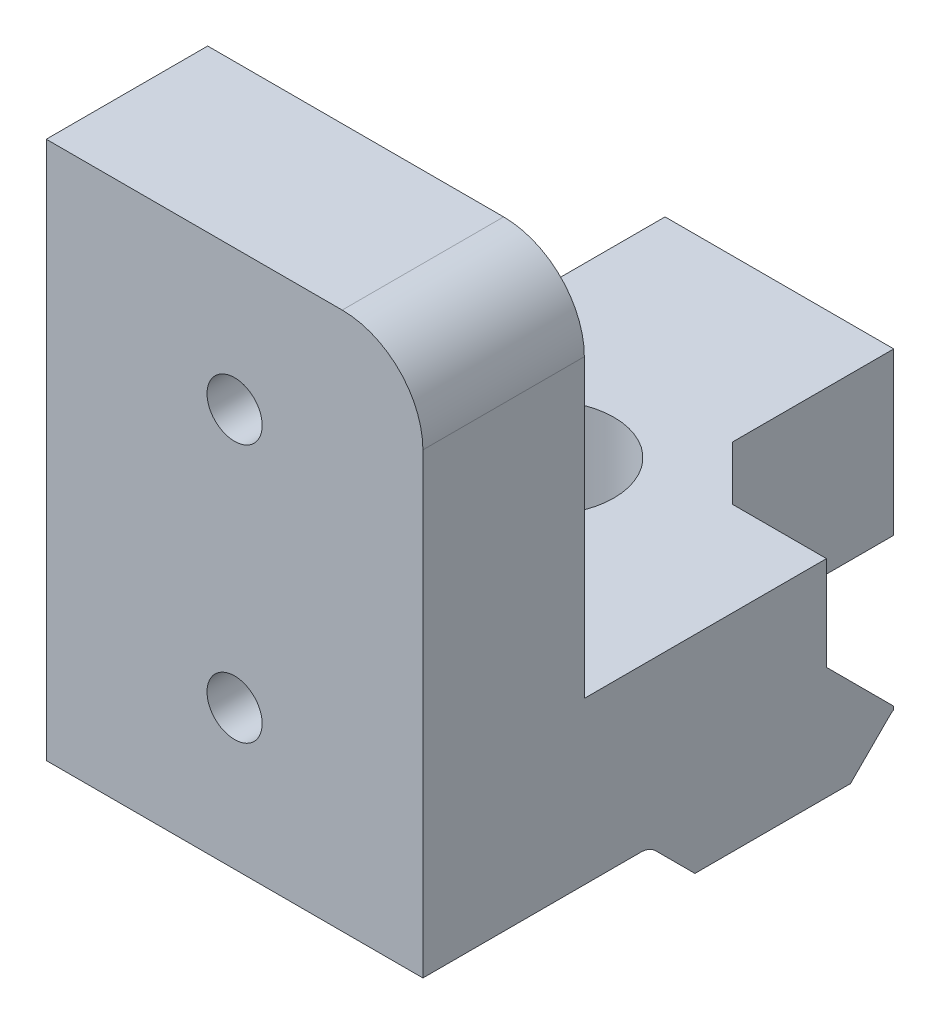
ISO-10303-21;
HEADER;
FILE_DESCRIPTION(('STEP AP214'),'2;1');
FILE_NAME('part.step','',(''),(''),'','','');
FILE_SCHEMA(('AUTOMOTIVE_DESIGN { 1 0 10303 214 1 1 1 1 }'));
ENDSEC;
DATA;
#1=APPLICATION_CONTEXT('core data for automotive mechanical design processes');
#2=APPLICATION_PROTOCOL_DEFINITION('international standard','automotive_design',2000,#1);
#3=PRODUCT_CONTEXT('',#1,'mechanical');
#4=PRODUCT('Part','Part','',(#3));
#5=PRODUCT_RELATED_PRODUCT_CATEGORY('part','',(#4));
#6=PRODUCT_DEFINITION_FORMATION('','',#4);
#7=PRODUCT_DEFINITION_CONTEXT('part definition',#1,'design');
#8=PRODUCT_DEFINITION('design','',#6,#7);
#9=PRODUCT_DEFINITION_SHAPE('','',#8);
#10=(LENGTH_UNIT() NAMED_UNIT(*) SI_UNIT(.MILLI.,.METRE.));
#11=(NAMED_UNIT(*) PLANE_ANGLE_UNIT() SI_UNIT($,.RADIAN.));
#12=(NAMED_UNIT(*) SI_UNIT($,.STERADIAN.) SOLID_ANGLE_UNIT());
#13=UNCERTAINTY_MEASURE_WITH_UNIT(LENGTH_MEASURE(1.E-05),#10,'distance_accuracy_value','');
#14=(GEOMETRIC_REPRESENTATION_CONTEXT(3) GLOBAL_UNCERTAINTY_ASSIGNED_CONTEXT((#13)) GLOBAL_UNIT_ASSIGNED_CONTEXT((#10,
#11,#12)) REPRESENTATION_CONTEXT('',''));
#15=CARTESIAN_POINT('',(0.,0.,0.));
#16=DIRECTION('',(0.,0.,1.));
#17=DIRECTION('',(1.,0.,0.));
#18=AXIS2_PLACEMENT_3D('',#15,#16,#17);
#19=CARTESIAN_POINT('',(46.3642843340703,35.7650594637958,0.));
#20=DIRECTION('',(0.,1.,0.));
#21=DIRECTION('',(0.,0.,1.));
#22=AXIS2_PLACEMENT_3D('',#19,#20,#21);
#23=PLANE('',#22);
#24=DIRECTION('',(-1.,0.,0.));
#25=VECTOR('',#24,1.);
#26=CARTESIAN_POINT('',(46.3642843340703,35.7650594637958,12.7830951969996));
#27=LINE('',#26,#25);
#28=CARTESIAN_POINT('',(46.3642843340703,35.7650594637958,12.7830951969996));
#29=VERTEX_POINT('',#28);
#30=CARTESIAN_POINT('',(32.3642843340703,35.7650594637958,12.7830951969996));
#31=VERTEX_POINT('',#30);
#32=EDGE_CURVE('E205',#29,#31,#27,.T.);
#33=ORIENTED_EDGE('',*,*,#32,.F.);
#34=DIRECTION('',(0.,0.,-1.));
#35=VECTOR('',#34,1.);
#36=CARTESIAN_POINT('',(46.3642843340703,35.7650594637958,0.));
#37=LINE('',#36,#35);
#38=CARTESIAN_POINT('',(46.3642843340703,35.7650594637958,20.8758664827248));
#39=VERTEX_POINT('',#38);
#40=EDGE_CURVE('E271',#39,#29,#37,.T.);
#41=ORIENTED_EDGE('',*,*,#40,.F.);
#42=DIRECTION('',(1.,0.,0.));
#43=VECTOR('',#42,1.);
#44=CARTESIAN_POINT('',(32.3642843340703,35.7650594637958,20.8758664827248));
#45=LINE('',#44,#43);
#46=CARTESIAN_POINT('',(32.3642843340703,35.7650594637958,20.8758664827248));
#47=VERTEX_POINT('',#46);
#48=EDGE_CURVE('E242',#47,#39,#45,.T.);
#49=ORIENTED_EDGE('',*,*,#48,.F.);
#50=DIRECTION('',(0.,0.,-1.));
#51=VECTOR('',#50,1.);
#52=CARTESIAN_POINT('',(32.3642843340703,35.7650594637958,0.));
#53=LINE('',#52,#51);
#54=EDGE_CURVE('E268',#47,#31,#53,.T.);
#55=ORIENTED_EDGE('',*,*,#54,.T.);
#56=EDGE_LOOP('',(#33,#41,#49,#55));
#57=FACE_BOUND('',#56,.T.);
#58=ADVANCED_FACE('F35',(#57),#23,.F.);
#59=CARTESIAN_POINT('',(46.3642843340703,34.9750594637958,12.7830951969996));
#60=DIRECTION('',(-1.,0.,0.));
#61=DIRECTION('',(0.,0.,1.));
#62=AXIS2_PLACEMENT_3D('',#59,#60,#61);
#63=CYLINDRICAL_SURFACE('',#62,0.789999999999999);
#64=CARTESIAN_POINT('',(32.3642843340703,34.9750594637958,12.7830951969996));
#65=DIRECTION('',(1.,0.,0.));
#66=DIRECTION('',(0.,0.,-1.));
#67=AXIS2_PLACEMENT_3D('',#64,#65,#66);
#68=CIRCLE('',#67,0.789999999999999);
#69=CARTESIAN_POINT('',(32.3642843340703,35.5336738209331,12.2244808398622));
#70=VERTEX_POINT('',#69);
#71=EDGE_CURVE('E291',#70,#31,#68,.T.);
#72=ORIENTED_EDGE('',*,*,#71,.F.);
#73=DIRECTION('',(-1.,0.,0.));
#74=VECTOR('',#73,1.);
#75=CARTESIAN_POINT('',(46.3642843340703,35.5336738209331,12.2244808398622));
#76=LINE('',#75,#74);
#77=CARTESIAN_POINT('',(46.3642843340703,35.5336738209331,12.2244808398622));
#78=VERTEX_POINT('',#77);
#79=EDGE_CURVE('E203',#78,#70,#76,.T.);
#80=ORIENTED_EDGE('',*,*,#79,.F.);
#81=CARTESIAN_POINT('',(46.3642843340703,34.9750594637958,12.7830951969996));
#82=DIRECTION('',(1.,0.,0.));
#83=DIRECTION('',(0.,0.,-1.));
#84=AXIS2_PLACEMENT_3D('',#81,#82,#83);
#85=CIRCLE('',#84,0.789999999999999);
#86=EDGE_CURVE('E273',#78,#29,#85,.T.);
#87=ORIENTED_EDGE('',*,*,#86,.T.);
#88=ORIENTED_EDGE('',*,*,#32,.T.);
#89=EDGE_LOOP('',(#72,#80,#87,#88));
#90=FACE_BOUND('',#89,.T.);
#91=ADVANCED_FACE('F341',(#90),#63,.F.);
#92=CARTESIAN_POINT('',(46.3642843340703,11.6545964905354,-11.6545964905355));
#93=DIRECTION('',(0.,-0.707106781186547,0.707106781186548));
#94=DIRECTION('',(0.,-0.707106781186548,-0.707106781186547));
#95=AXIS2_PLACEMENT_3D('',#92,#93,#94);
#96=PLANE('',#95);
#97=DIRECTION('',(0.,0.707106781186548,0.707106781186547));
#98=VECTOR('',#97,1.);
#99=CARTESIAN_POINT('',(32.3642843340703,11.6545964905354,-11.6545964905355));
#100=LINE('',#99,#98);
#101=CARTESIAN_POINT('',(32.3642843340703,34.0750594637958,10.7658664827248));
#102=VERTEX_POINT('',#101);
#103=EDGE_CURVE('E295',#102,#70,#100,.T.);
#104=ORIENTED_EDGE('',*,*,#103,.F.);
#105=DIRECTION('',(-1.,0.,0.));
#106=VECTOR('',#105,1.);
#107=CARTESIAN_POINT('',(46.3642843340703,34.0750594637958,10.7658664827248));
#108=LINE('',#107,#106);
#109=CARTESIAN_POINT('',(46.3642843340703,34.0750594637958,10.7658664827248));
#110=VERTEX_POINT('',#109);
#111=EDGE_CURVE('E201',#110,#102,#108,.T.);
#112=ORIENTED_EDGE('',*,*,#111,.F.);
#113=DIRECTION('',(0.,0.707106781186548,0.707106781186547));
#114=VECTOR('',#113,1.);
#115=CARTESIAN_POINT('',(46.3642843340703,11.6545964905354,-11.6545964905355));
#116=LINE('',#115,#114);
#117=EDGE_CURVE('E277',#110,#78,#116,.T.);
#118=ORIENTED_EDGE('',*,*,#117,.T.);
#119=ORIENTED_EDGE('',*,*,#79,.T.);
#120=EDGE_LOOP('',(#104,#112,#118,#119));
#121=FACE_BOUND('',#120,.T.);
#122=ADVANCED_FACE('F337',(#121),#96,.T.);
#123=CARTESIAN_POINT('',(46.3642843340703,34.0750594637958,0.));
#124=DIRECTION('',(0.,1.,0.));
#125=DIRECTION('',(0.,0.,1.));
#126=AXIS2_PLACEMENT_3D('',#123,#124,#125);
#127=PLANE('',#126);
#128=CARTESIAN_POINT('',(37.8642843340703,34.0750594637958,7.87586648272481));
#129=DIRECTION('',(0.,-1.,0.));
#130=DIRECTION('',(0.,0.,-1.));
#131=AXIS2_PLACEMENT_3D('',#128,#129,#130);
#132=CIRCLE('',#131,2.6);
#133=CARTESIAN_POINT('',(37.8642843340703,34.0750594637958,5.27586648272481));
#134=VERTEX_POINT('',#133);
#135=EDGE_CURVE('E265',#134,#134,#132,.T.);
#136=ORIENTED_EDGE('',*,*,#135,.F.);
#137=EDGE_LOOP('',(#136));
#138=FACE_BOUND('',#137,.T.);
#139=DIRECTION('',(0.,0.,-1.));
#140=VECTOR('',#139,1.);
#141=CARTESIAN_POINT('',(32.3642843340703,34.0750594637958,0.));
#142=LINE('',#141,#140);
#143=CARTESIAN_POINT('',(32.3642843340703,34.0750594637958,4.98586648272482));
#144=VERTEX_POINT('',#143);
#145=EDGE_CURVE('E298',#102,#144,#142,.T.);
#146=ORIENTED_EDGE('',*,*,#145,.T.);
#147=DIRECTION('',(-1.,0.,0.));
#148=VECTOR('',#147,1.);
#149=CARTESIAN_POINT('',(46.3642843340703,34.0750594637958,4.98586648272482));
#150=LINE('',#149,#148);
#151=CARTESIAN_POINT('',(46.3642843340703,34.0750594637958,4.98586648272482));
#152=VERTEX_POINT('',#151);
#153=EDGE_CURVE('E194',#152,#144,#150,.T.);
#154=ORIENTED_EDGE('',*,*,#153,.F.);
#155=DIRECTION('',(0.,0.,-1.));
#156=VECTOR('',#155,1.);
#157=CARTESIAN_POINT('',(46.3642843340703,34.0750594637958,0.));
#158=LINE('',#157,#156);
#159=EDGE_CURVE('E280',#110,#152,#158,.T.);
#160=ORIENTED_EDGE('',*,*,#159,.F.);
#161=ORIENTED_EDGE('',*,*,#111,.T.);
#162=EDGE_LOOP('',(#146,#154,#160,#161));
#163=FACE_BOUND('',#162,.T.);
#164=ADVANCED_FACE('F334',(#138,#163),#127,.F.);
#165=CARTESIAN_POINT('',(46.3642843340703,19.5304629732602,19.5304629732603));
#166=DIRECTION('',(0.,-0.707106781186547,-0.707106781186549));
#167=DIRECTION('',(0.,0.707106781186549,-0.707106781186546));
#168=AXIS2_PLACEMENT_3D('',#165,#166,#167);
#169=PLANE('',#168);
#170=DIRECTION('',(0.,-0.707106781186549,0.707106781186546));
#171=VECTOR('',#170,1.);
#172=CARTESIAN_POINT('',(32.3642843340703,19.5304629732602,19.5304629732603));
#173=LINE('',#172,#171);
#174=CARTESIAN_POINT('',(32.3642843340703,35.5336738209331,3.52725212558745));
#175=VERTEX_POINT('',#174);
#176=EDGE_CURVE('E301',#175,#144,#173,.T.);
#177=ORIENTED_EDGE('',*,*,#176,.F.);
#178=DIRECTION('',(-1.,0.,0.));
#179=VECTOR('',#178,1.);
#180=CARTESIAN_POINT('',(46.3642843340703,35.5336738209331,3.52725212558745));
#181=LINE('',#180,#179);
#182=CARTESIAN_POINT('',(46.3642843340703,35.5336738209331,3.52725212558745));
#183=VERTEX_POINT('',#182);
#184=EDGE_CURVE('E192',#183,#175,#181,.T.);
#185=ORIENTED_EDGE('',*,*,#184,.F.);
#186=DIRECTION('',(0.,-0.707106781186549,0.707106781186546));
#187=VECTOR('',#186,1.);
#188=CARTESIAN_POINT('',(46.3642843340703,19.5304629732602,19.5304629732603));
#189=LINE('',#188,#187);
#190=EDGE_CURVE('E282',#183,#152,#189,.T.);
#191=ORIENTED_EDGE('',*,*,#190,.T.);
#192=ORIENTED_EDGE('',*,*,#153,.T.);
#193=EDGE_LOOP('',(#177,#185,#191,#192));
#194=FACE_BOUND('',#193,.T.);
#195=ADVANCED_FACE('F329',(#194),#169,.T.);
#196=CARTESIAN_POINT('',(46.3642843340703,34.9750594637958,2.96863776845007));
#197=DIRECTION('',(-1.,0.,0.));
#198=DIRECTION('',(0.,0.,1.));
#199=AXIS2_PLACEMENT_3D('',#196,#197,#198);
#200=CYLINDRICAL_SURFACE('',#199,0.790000000000005);
#201=DIRECTION('',(-1.,0.,0.));
#202=VECTOR('',#201,1.);
#203=CARTESIAN_POINT('',(46.3642843340703,35.6520120280646,3.37586648272482));
#204=LINE('',#203,#202);
#205=CARTESIAN_POINT('',(46.3642843340703,35.6520120280646,3.37586648272482));
#206=VERTEX_POINT('',#205);
#207=CARTESIAN_POINT('',(40.8642843340703,35.6520120280646,3.37586648272482));
#208=VERTEX_POINT('',#207);
#209=EDGE_CURVE('E176',#206,#208,#204,.T.);
#210=ORIENTED_EDGE('',*,*,#209,.F.);
#211=CARTESIAN_POINT('',(46.3642843340703,34.9750594637958,2.96863776845007));
#212=DIRECTION('',(1.,0.,0.));
#213=DIRECTION('',(0.,0.,-1.));
#214=AXIS2_PLACEMENT_3D('',#211,#212,#213);
#215=CIRCLE('',#214,0.790000000000005);
#216=EDGE_CURVE('E285',#206,#183,#215,.T.);
#217=ORIENTED_EDGE('',*,*,#216,.T.);
#218=ORIENTED_EDGE('',*,*,#184,.T.);
#219=CARTESIAN_POINT('',(32.3642843340703,34.9750594637958,2.96863776845007));
#220=DIRECTION('',(1.,0.,0.));
#221=DIRECTION('',(0.,0.,-1.));
#222=AXIS2_PLACEMENT_3D('',#219,#220,#221);
#223=CIRCLE('',#222,0.790000000000005);
#224=CARTESIAN_POINT('',(32.3642843340703,35.7650594637958,2.96863776845007));
#225=VERTEX_POINT('',#224);
#226=EDGE_CURVE('E191',#225,#175,#223,.T.);
#227=ORIENTED_EDGE('',*,*,#226,.F.);
#228=DIRECTION('',(-1.,0.,0.));
#229=VECTOR('',#228,1.);
#230=CARTESIAN_POINT('',(46.3642843340703,35.7650594637958,2.96863776845007));
#231=LINE('',#230,#229);
#232=CARTESIAN_POINT('',(40.8642843340703,35.7650594637958,2.96863776845007));
#233=VERTEX_POINT('',#232);
#234=EDGE_CURVE('E182',#233,#225,#231,.T.);
#235=ORIENTED_EDGE('',*,*,#234,.F.);
#236=CARTESIAN_POINT('',(40.8642843340703,34.9750594637958,2.96863776845007));
#237=DIRECTION('',(-1.,0.,0.));
#238=DIRECTION('',(0.,0.,1.));
#239=AXIS2_PLACEMENT_3D('',#236,#237,#238);
#240=CIRCLE('',#239,0.790000000000005);
#241=EDGE_CURVE('E164',#208,#233,#240,.T.);
#242=ORIENTED_EDGE('',*,*,#241,.F.);
#243=EDGE_LOOP('',(#210,#217,#218,#227,#235,#242));
#244=FACE_BOUND('',#243,.T.);
#245=ADVANCED_FACE('F189',(#244),#200,.F.);
#246=DIRECTION('',(-1.,0.,0.));
#247=VECTOR('',#246,1.);
#248=CARTESIAN_POINT('',(46.3642843340703,35.7650594637958,-2.12413351727518));
#249=LINE('',#248,#247);
#250=CARTESIAN_POINT('',(40.8642843340703,35.7650594637958,-2.12413351727518));
#251=VERTEX_POINT('',#250);
#252=CARTESIAN_POINT('',(32.3642843340703,35.7650594637958,-2.12413351727518));
#253=VERTEX_POINT('',#252);
#254=EDGE_CURVE('E184',#251,#253,#249,.T.);
#255=ORIENTED_EDGE('',*,*,#254,.F.);
#256=DIRECTION('',(0.,0.,-1.));
#257=VECTOR('',#256,1.);
#258=CARTESIAN_POINT('',(40.8642843340703,35.7650594637958,5.87586648272482));
#259=LINE('',#258,#257);
#260=EDGE_CURVE('E168',#233,#251,#259,.T.);
#261=ORIENTED_EDGE('',*,*,#260,.F.);
#262=ORIENTED_EDGE('',*,*,#234,.T.);
#263=EDGE_CURVE('E292',#225,#253,#53,.T.);
#264=ORIENTED_EDGE('',*,*,#263,.T.);
#265=EDGE_LOOP('',(#255,#261,#262,#264));
#266=FACE_BOUND('',#265,.T.);
#267=ADVANCED_FACE('F180',(#266),#23,.F.);
#268=CARTESIAN_POINT('',(46.3642843340703,0.,-2.12413351727518));
#269=DIRECTION('',(0.,0.,1.));
#270=DIRECTION('',(1.,0.,0.));
#271=AXIS2_PLACEMENT_3D('',#268,#269,#270);
#272=PLANE('',#271);
#273=DIRECTION('',(-1.,0.,0.));
#274=VECTOR('',#273,1.);
#275=CARTESIAN_POINT('',(46.3642843340703,41.7650594637958,-2.12413351727518));
#276=LINE('',#275,#274);
#277=CARTESIAN_POINT('',(40.8642843340703,41.7650594637958,-2.12413351727518));
#278=VERTEX_POINT('',#277);
#279=CARTESIAN_POINT('',(32.3642843340703,41.7650594637958,-2.12413351727518));
#280=VERTEX_POINT('',#279);
#281=EDGE_CURVE('E196',#278,#280,#276,.T.);
#282=ORIENTED_EDGE('',*,*,#281,.F.);
#283=DIRECTION('',(0.,1.,0.));
#284=VECTOR('',#283,1.);
#285=CARTESIAN_POINT('',(40.8642843340703,26.056815544322,-2.12413351727518));
#286=LINE('',#285,#284);
#287=EDGE_CURVE('E186',#251,#278,#286,.T.);
#288=ORIENTED_EDGE('',*,*,#287,.F.);
#289=ORIENTED_EDGE('',*,*,#254,.T.);
#290=DIRECTION('',(0.,1.,0.));
#291=VECTOR('',#290,1.);
#292=CARTESIAN_POINT('',(32.3642843340703,0.,-2.12413351727518));
#293=LINE('',#292,#291);
#294=EDGE_CURVE('E305',#253,#280,#293,.T.);
#295=ORIENTED_EDGE('',*,*,#294,.T.);
#296=EDGE_LOOP('',(#282,#288,#289,#295));
#297=FACE_BOUND('',#296,.T.);
#298=ADVANCED_FACE('F323',(#297),#272,.F.);
#299=CARTESIAN_POINT('',(46.3642843340703,41.7650594637958,0.));
#300=DIRECTION('',(0.,1.,0.));
#301=DIRECTION('',(0.,0.,1.));
#302=AXIS2_PLACEMENT_3D('',#299,#300,#301);
#303=PLANE('',#302);
#304=DIRECTION('',(0.,0.,1.));
#305=VECTOR('',#304,1.);
#306=CARTESIAN_POINT('',(40.8642843340703,41.7650594637958,5.87586648272482));
#307=LINE('',#306,#305);
#308=CARTESIAN_POINT('',(40.8642843340703,41.7650594637958,3.87586648272482));
#309=VERTEX_POINT('',#308);
#310=EDGE_CURVE('E175',#278,#309,#307,.T.);
#311=ORIENTED_EDGE('',*,*,#310,.F.);
#312=ORIENTED_EDGE('',*,*,#281,.T.);
#313=DIRECTION('',(0.,0.,-1.));
#314=VECTOR('',#313,1.);
#315=CARTESIAN_POINT('',(32.3642843340703,41.7650594637958,0.));
#316=LINE('',#315,#314);
#317=CARTESIAN_POINT('',(32.3642843340703,41.7650594637958,14.8758664827248));
#318=VERTEX_POINT('',#317);
#319=EDGE_CURVE('E274',#318,#280,#316,.T.);
#320=ORIENTED_EDGE('',*,*,#319,.F.);
#321=DIRECTION('',(-1.,0.,0.));
#322=VECTOR('',#321,1.);
#323=CARTESIAN_POINT('',(46.3642843340703,41.7650594637958,14.8758664827248));
#324=LINE('',#323,#322);
#325=CARTESIAN_POINT('',(38.7234840531715,41.7650594637958,14.8758664827248));
#326=VERTEX_POINT('',#325);
#327=EDGE_CURVE('E259',#326,#318,#324,.T.);
#328=ORIENTED_EDGE('',*,*,#327,.F.);
#329=CARTESIAN_POINT('',(40.0050846149692,41.7650594637958,14.8758664827248));
#330=VERTEX_POINT('',#329);
#331=EDGE_CURVE('E264',#330,#326,#324,.T.);
#332=ORIENTED_EDGE('',*,*,#331,.F.);
#333=CARTESIAN_POINT('',(46.3642843340703,41.7650594637958,14.8758664827248));
#334=VERTEX_POINT('',#333);
#335=EDGE_CURVE('E260',#334,#330,#324,.T.);
#336=ORIENTED_EDGE('',*,*,#335,.F.);
#337=DIRECTION('',(0.,0.,-1.));
#338=VECTOR('',#337,1.);
#339=CARTESIAN_POINT('',(46.3642843340703,41.7650594637958,0.));
#340=LINE('',#339,#338);
#341=CARTESIAN_POINT('',(46.3642843340703,41.7650594637958,5.87586648272482));
#342=VERTEX_POINT('',#341);
#343=EDGE_CURVE('E287',#334,#342,#340,.T.);
#344=ORIENTED_EDGE('',*,*,#343,.T.);
#345=DIRECTION('',(1.,0.,0.));
#346=VECTOR('',#345,1.);
#347=CARTESIAN_POINT('',(40.8642843340703,41.7650594637958,5.87586648272482));
#348=LINE('',#347,#346);
#349=CARTESIAN_POINT('',(42.8642843340704,41.7650594637958,5.87586648272482));
#350=VERTEX_POINT('',#349);
#351=EDGE_CURVE('E360',#350,#342,#348,.T.);
#352=ORIENTED_EDGE('',*,*,#351,.F.);
#353=DIRECTION('',(0.707106781186552,0.,0.707106781186543));
#354=VECTOR('',#353,1.);
#355=CARTESIAN_POINT('',(42.8642843340704,41.7650594637958,5.87586648272482));
#356=LINE('',#355,#354);
#357=EDGE_CURVE('E212',#350,#309,#356,.F.);
#358=ORIENTED_EDGE('',*,*,#357,.T.);
#359=EDGE_LOOP('',(#311,#312,#320,#328,#332,#336,#344,#352,#358));
#360=FACE_BOUND('',#359,.T.);
#361=CARTESIAN_POINT('',(37.8642843340703,41.7650594637958,7.87586648272481));
#362=DIRECTION('',(0.,1.,0.));
#363=DIRECTION('',(0.,0.,1.));
#364=AXIS2_PLACEMENT_3D('',#361,#362,#363);
#365=CIRCLE('',#364,2.6);
#366=CARTESIAN_POINT('',(37.8642843340703,41.7650594637958,10.4758664827248));
#367=VERTEX_POINT('',#366);
#368=EDGE_CURVE('E263',#367,#367,#365,.F.);
#369=ORIENTED_EDGE('',*,*,#368,.T.);
#370=EDGE_LOOP('',(#369));
#371=FACE_BOUND('',#370,.T.);
#372=ADVANCED_FACE('F313',(#360,#371),#303,.T.);
#373=CARTESIAN_POINT('',(46.3642843340703,0.,0.));
#374=DIRECTION('',(1.,0.,0.));
#375=DIRECTION('',(0.,0.,-1.));
#376=AXIS2_PLACEMENT_3D('',#373,#374,#375);
#377=PLANE('',#376);
#378=DIRECTION('',(0.,1.,0.));
#379=VECTOR('',#378,1.);
#380=CARTESIAN_POINT('',(46.3642843340703,35.7650594637958,14.8758664827248));
#381=LINE('',#380,#379);
#382=CARTESIAN_POINT('',(46.3642843340703,52.7650594637958,14.8758664827248));
#383=VERTEX_POINT('',#382);
#384=EDGE_CURVE('E235',#334,#383,#381,.T.);
#385=ORIENTED_EDGE('',*,*,#384,.T.);
#386=DIRECTION('',(0.,0.,1.));
#387=VECTOR('',#386,1.);
#388=CARTESIAN_POINT('',(46.3642843340703,52.7650594637958,0.));
#389=LINE('',#388,#387);
#390=CARTESIAN_POINT('',(46.3642843340703,52.7650594637958,20.8758664827248));
#391=VERTEX_POINT('',#390);
#392=EDGE_CURVE('E225',#383,#391,#389,.T.);
#393=ORIENTED_EDGE('',*,*,#392,.T.);
#394=DIRECTION('',(0.,1.,0.));
#395=VECTOR('',#394,1.);
#396=CARTESIAN_POINT('',(46.3642843340703,35.7650594637958,20.8758664827248));
#397=LINE('',#396,#395);
#398=EDGE_CURVE('E233',#39,#391,#397,.T.);
#399=ORIENTED_EDGE('',*,*,#398,.F.);
#400=ORIENTED_EDGE('',*,*,#40,.T.);
#401=ORIENTED_EDGE('',*,*,#86,.F.);
#402=ORIENTED_EDGE('',*,*,#117,.F.);
#403=ORIENTED_EDGE('',*,*,#159,.T.);
#404=ORIENTED_EDGE('',*,*,#190,.F.);
#405=ORIENTED_EDGE('',*,*,#216,.F.);
#406=DIRECTION('',(0.,1.,0.));
#407=VECTOR('',#406,1.);
#408=CARTESIAN_POINT('',(46.3642843340703,34.0750594637958,3.37586648272482));
#409=LINE('',#408,#407);
#410=CARTESIAN_POINT('',(46.3642843340703,35.7650594637958,3.37586648272482));
#411=VERTEX_POINT('',#410);
#412=EDGE_CURVE('E366',#206,#411,#409,.T.);
#413=ORIENTED_EDGE('',*,*,#412,.T.);
#414=DIRECTION('',(0.,0.707106781186551,0.707106781186544));
#415=VECTOR('',#414,1.);
#416=CARTESIAN_POINT('',(46.3642843340703,38.2650594637958,5.87586648272482));
#417=LINE('',#416,#415);
#418=CARTESIAN_POINT('',(46.3642843340703,38.2650594637958,5.87586648272482));
#419=VERTEX_POINT('',#418);
#420=EDGE_CURVE('E223',#411,#419,#417,.T.);
#421=ORIENTED_EDGE('',*,*,#420,.T.);
#422=DIRECTION('',(0.,1.,0.));
#423=VECTOR('',#422,1.);
#424=CARTESIAN_POINT('',(46.3642843340703,26.056815544322,5.87586648272482));
#425=LINE('',#424,#423);
#426=EDGE_CURVE('E358',#419,#342,#425,.T.);
#427=ORIENTED_EDGE('',*,*,#426,.T.);
#428=ORIENTED_EDGE('',*,*,#343,.F.);
#429=EDGE_LOOP('',(#385,#393,#399,#400,#401,#402,#403,#404,#405,#413,#421,#427,#428));
#430=FACE_BOUND('',#429,.T.);
#431=ADVANCED_FACE('F232',(#430),#377,.T.);
#432=CARTESIAN_POINT('',(32.3642843340703,0.,0.));
#433=DIRECTION('',(1.,0.,0.));
#434=DIRECTION('',(0.,0.,-1.));
#435=AXIS2_PLACEMENT_3D('',#432,#433,#434);
#436=PLANE('',#435);
#437=DIRECTION('',(0.,-1.,0.));
#438=VECTOR('',#437,1.);
#439=CARTESIAN_POINT('',(32.3642843340703,35.7650594637958,14.8758664827248));
#440=LINE('',#439,#438);
#441=CARTESIAN_POINT('',(32.3642843340703,55.7650594637958,14.8758664827248));
#442=VERTEX_POINT('',#441);
#443=EDGE_CURVE('E245',#442,#318,#440,.T.);
#444=ORIENTED_EDGE('',*,*,#443,.T.);
#445=ORIENTED_EDGE('',*,*,#319,.T.);
#446=ORIENTED_EDGE('',*,*,#294,.F.);
#447=ORIENTED_EDGE('',*,*,#263,.F.);
#448=ORIENTED_EDGE('',*,*,#226,.T.);
#449=ORIENTED_EDGE('',*,*,#176,.T.);
#450=ORIENTED_EDGE('',*,*,#145,.F.);
#451=ORIENTED_EDGE('',*,*,#103,.T.);
#452=ORIENTED_EDGE('',*,*,#71,.T.);
#453=ORIENTED_EDGE('',*,*,#54,.F.);
#454=DIRECTION('',(0.,-1.,0.));
#455=VECTOR('',#454,1.);
#456=CARTESIAN_POINT('',(32.3642843340703,35.7650594637958,20.8758664827248));
#457=LINE('',#456,#455);
#458=CARTESIAN_POINT('',(32.3642843340703,55.7650594637958,20.8758664827248));
#459=VERTEX_POINT('',#458);
#460=EDGE_CURVE('E247',#459,#47,#457,.T.);
#461=ORIENTED_EDGE('',*,*,#460,.F.);
#462=DIRECTION('',(0.,0.,1.));
#463=VECTOR('',#462,1.);
#464=CARTESIAN_POINT('',(32.3642843340703,55.7650594637958,14.8758664827248));
#465=LINE('',#464,#463);
#466=EDGE_CURVE('E256',#442,#459,#465,.T.);
#467=ORIENTED_EDGE('',*,*,#466,.F.);
#468=EDGE_LOOP('',(#444,#445,#446,#447,#448,#449,#450,#451,#452,#453,#461,#467));
#469=FACE_BOUND('',#468,.T.);
#470=ADVANCED_FACE('F320',(#469),#436,.F.);
#471=CARTESIAN_POINT('',(37.8642843340703,41.7660594637958,7.87586648272481));
#472=DIRECTION('',(0.,-1.,0.));
#473=DIRECTION('',(0.,0.,-1.));
#474=AXIS2_PLACEMENT_3D('',#471,#472,#473);
#475=CYLINDRICAL_SURFACE('',#474,2.6);
#476=ORIENTED_EDGE('',*,*,#368,.F.);
#477=EDGE_LOOP('',(#476));
#478=FACE_BOUND('',#477,.T.);
#479=ORIENTED_EDGE('',*,*,#135,.T.);
#480=EDGE_LOOP('',(#479));
#481=FACE_BOUND('',#480,.T.);
#482=ADVANCED_FACE('F453',(#478,#481),#475,.F.);
#483=CARTESIAN_POINT('',(32.3642843340703,55.7650594637958,14.8758664827248));
#484=DIRECTION('',(0.,1.,0.));
#485=DIRECTION('',(0.,0.,1.));
#486=AXIS2_PLACEMENT_3D('',#483,#484,#485);
#487=PLANE('',#486);
#488=DIRECTION('',(-1.,0.,0.));
#489=VECTOR('',#488,1.);
#490=CARTESIAN_POINT('',(32.3642843340703,55.7650594637958,20.8758664827248));
#491=LINE('',#490,#489);
#492=CARTESIAN_POINT('',(43.3642843340703,55.7650594637958,20.8758664827248));
#493=VERTEX_POINT('',#492);
#494=EDGE_CURVE('E243',#493,#459,#491,.T.);
#495=ORIENTED_EDGE('',*,*,#494,.F.);
#496=DIRECTION('',(0.,0.,1.));
#497=VECTOR('',#496,1.);
#498=CARTESIAN_POINT('',(43.3642843340703,55.7650594637958,14.8758664827248));
#499=LINE('',#498,#497);
#500=CARTESIAN_POINT('',(43.3642843340703,55.7650594637958,14.8758664827248));
#501=VERTEX_POINT('',#500);
#502=EDGE_CURVE('E43',#493,#501,#499,.F.);
#503=ORIENTED_EDGE('',*,*,#502,.T.);
#504=DIRECTION('',(-1.,0.,0.));
#505=VECTOR('',#504,1.);
#506=CARTESIAN_POINT('',(32.3642843340703,55.7650594637958,14.8758664827248));
#507=LINE('',#506,#505);
#508=EDGE_CURVE('E254',#501,#442,#507,.T.);
#509=ORIENTED_EDGE('',*,*,#508,.T.);
#510=ORIENTED_EDGE('',*,*,#466,.T.);
#511=EDGE_LOOP('',(#495,#503,#509,#510));
#512=FACE_BOUND('',#511,.T.);
#513=ADVANCED_FACE('F449',(#512),#487,.T.);
#514=CARTESIAN_POINT('',(0.,0.,14.8758664827248));
#515=DIRECTION('',(0.,0.,-1.));
#516=DIRECTION('',(-1.,0.,0.));
#517=AXIS2_PLACEMENT_3D('',#514,#515,#516);
#518=PLANE('',#517);
#519=ORIENTED_EDGE('',*,*,#508,.F.);
#520=CARTESIAN_POINT('',(43.3642843340703,52.7650594637958,14.8758664827248));
#521=DIRECTION('',(0.,0.,-1.));
#522=DIRECTION('',(-1.,0.,0.));
#523=AXIS2_PLACEMENT_3D('',#520,#521,#522);
#524=CIRCLE('',#523,3.);
#525=EDGE_CURVE('E11',#501,#383,#524,.T.);
#526=ORIENTED_EDGE('',*,*,#525,.T.);
#527=ORIENTED_EDGE('',*,*,#384,.F.);
#528=ORIENTED_EDGE('',*,*,#335,.T.);
#529=CARTESIAN_POINT('',(39.3642843340703,40.9650594637958,14.8758664827248));
#530=DIRECTION('',(0.,0.,1.));
#531=DIRECTION('',(1.,0.,0.));
#532=AXIS2_PLACEMENT_3D('',#529,#530,#531);
#533=CIRCLE('',#532,1.025);
#534=EDGE_CURVE('E351',#330,#326,#533,.T.);
#535=ORIENTED_EDGE('',*,*,#534,.T.);
#536=ORIENTED_EDGE('',*,*,#327,.T.);
#537=ORIENTED_EDGE('',*,*,#443,.F.);
#538=EDGE_LOOP('',(#519,#526,#527,#528,#535,#536,#537));
#539=FACE_BOUND('',#538,.T.);
#540=CARTESIAN_POINT('',(39.3642843340703,50.5650594637958,14.8758664827248));
#541=DIRECTION('',(0.,0.,1.));
#542=DIRECTION('',(1.,0.,0.));
#543=AXIS2_PLACEMENT_3D('',#540,#541,#542);
#544=CIRCLE('',#543,1.025);
#545=CARTESIAN_POINT('',(40.3892843340703,50.5650594637958,14.8758664827248));
#546=VERTEX_POINT('',#545);
#547=EDGE_CURVE('E345',#546,#546,#544,.T.);
#548=ORIENTED_EDGE('',*,*,#547,.T.);
#549=EDGE_LOOP('',(#548));
#550=FACE_BOUND('',#549,.T.);
#551=ADVANCED_FACE('F390',(#539,#550),#518,.T.);
#552=CARTESIAN_POINT('',(0.,0.,20.8758664827248));
#553=DIRECTION('',(0.,0.,-1.));
#554=DIRECTION('',(-1.,0.,0.));
#555=AXIS2_PLACEMENT_3D('',#552,#553,#554);
#556=PLANE('',#555);
#557=CARTESIAN_POINT('',(39.3642843340703,40.9650594637958,20.8758664827248));
#558=DIRECTION('',(0.,0.,1.));
#559=DIRECTION('',(1.,0.,0.));
#560=AXIS2_PLACEMENT_3D('',#557,#558,#559);
#561=CIRCLE('',#560,1.025);
#562=CARTESIAN_POINT('',(40.3892843340703,40.9650594637958,20.8758664827248));
#563=VERTEX_POINT('',#562);
#564=EDGE_CURVE('E185',#563,#563,#561,.T.);
#565=ORIENTED_EDGE('',*,*,#564,.F.);
#566=EDGE_LOOP('',(#565));
#567=FACE_BOUND('',#566,.T.);
#568=CARTESIAN_POINT('',(39.3642843340703,50.5650594637958,20.8758664827248));
#569=DIRECTION('',(0.,0.,1.));
#570=DIRECTION('',(1.,0.,0.));
#571=AXIS2_PLACEMENT_3D('',#568,#569,#570);
#572=CIRCLE('',#571,1.025);
#573=CARTESIAN_POINT('',(40.3892843340703,50.5650594637958,20.8758664827248));
#574=VERTEX_POINT('',#573);
#575=EDGE_CURVE('E347',#574,#574,#572,.T.);
#576=ORIENTED_EDGE('',*,*,#575,.F.);
#577=EDGE_LOOP('',(#576));
#578=FACE_BOUND('',#577,.T.);
#579=ORIENTED_EDGE('',*,*,#398,.T.);
#580=CARTESIAN_POINT('',(43.3642843340703,52.7650594637958,20.8758664827248));
#581=DIRECTION('',(0.,0.,-1.));
#582=DIRECTION('',(-1.,0.,0.));
#583=AXIS2_PLACEMENT_3D('',#580,#581,#582);
#584=CIRCLE('',#583,3.);
#585=EDGE_CURVE('E57',#391,#493,#584,.F.);
#586=ORIENTED_EDGE('',*,*,#585,.T.);
#587=ORIENTED_EDGE('',*,*,#494,.T.);
#588=ORIENTED_EDGE('',*,*,#460,.T.);
#589=ORIENTED_EDGE('',*,*,#48,.T.);
#590=EDGE_LOOP('',(#579,#586,#587,#588,#589));
#591=FACE_BOUND('',#590,.T.);
#592=ADVANCED_FACE('F239',(#567,#578,#591),#556,.F.);
#593=CARTESIAN_POINT('',(39.3642843340703,50.5650594637958,14.8758664827248));
#594=DIRECTION('',(0.,0.,1.));
#595=DIRECTION('',(1.,0.,0.));
#596=AXIS2_PLACEMENT_3D('',#593,#594,#595);
#597=CYLINDRICAL_SURFACE('',#596,1.025);
#598=ORIENTED_EDGE('',*,*,#547,.F.);
#599=EDGE_LOOP('',(#598));
#600=FACE_BOUND('',#599,.T.);
#601=ORIENTED_EDGE('',*,*,#575,.T.);
#602=EDGE_LOOP('',(#601));
#603=FACE_BOUND('',#602,.T.);
#604=ADVANCED_FACE('F466',(#600,#603),#597,.F.);
#605=CARTESIAN_POINT('',(39.3642843340703,40.9650594637958,14.8758664827248));
#606=DIRECTION('',(0.,0.,1.));
#607=DIRECTION('',(1.,0.,0.));
#608=AXIS2_PLACEMENT_3D('',#605,#606,#607);
#609=CYLINDRICAL_SURFACE('',#608,1.025);
#610=ORIENTED_EDGE('',*,*,#534,.F.);
#611=EDGE_CURVE('E355',#326,#330,#533,.T.);
#612=ORIENTED_EDGE('',*,*,#611,.F.);
#613=EDGE_LOOP('',(#610,#612));
#614=FACE_BOUND('',#613,.T.);
#615=ORIENTED_EDGE('',*,*,#564,.T.);
#616=EDGE_LOOP('',(#615));
#617=FACE_BOUND('',#616,.T.);
#618=ADVANCED_FACE('F481',(#614,#617),#609,.F.);
#619=CARTESIAN_POINT('',(39.3642843340703,40.9650594637958,14.8758664827248));
#620=DIRECTION('',(0.,0.,1.));
#621=DIRECTION('',(1.,0.,0.));
#622=AXIS2_PLACEMENT_3D('',#619,#620,#621);
#623=PLANE('',#622);
#624=ORIENTED_EDGE('',*,*,#611,.T.);
#625=ORIENTED_EDGE('',*,*,#331,.T.);
#626=EDGE_LOOP('',(#624,#625));
#627=FACE_BOUND('',#626,.T.);
#628=ADVANCED_FACE('F489',(#627),#623,.T.);
#629=CARTESIAN_POINT('',(40.8642843340703,26.056815544322,5.87586648272482));
#630=DIRECTION('',(-1.,0.,0.));
#631=DIRECTION('',(0.,0.,1.));
#632=AXIS2_PLACEMENT_3D('',#629,#630,#631);
#633=PLANE('',#632);
#634=DIRECTION('',(0.,-1.,0.));
#635=VECTOR('',#634,1.);
#636=CARTESIAN_POINT('',(40.8642843340703,35.7650594637958,3.87586648272482));
#637=LINE('',#636,#635);
#638=CARTESIAN_POINT('',(40.8642843340703,36.2650594637958,3.87586648272482));
#639=VERTEX_POINT('',#638);
#640=EDGE_CURVE('E210',#309,#639,#637,.T.);
#641=ORIENTED_EDGE('',*,*,#640,.T.);
#642=DIRECTION('',(0.,-0.707106781186551,-0.707106781186544));
#643=VECTOR('',#642,1.);
#644=CARTESIAN_POINT('',(40.8642843340703,38.2650594637958,5.87586648272482));
#645=LINE('',#644,#643);
#646=CARTESIAN_POINT('',(40.8642843340703,35.7650594637958,3.37586648272482));
#647=VERTEX_POINT('',#646);
#648=EDGE_CURVE('E219',#639,#647,#645,.T.);
#649=ORIENTED_EDGE('',*,*,#648,.T.);
#650=DIRECTION('',(0.,1.,0.));
#651=VECTOR('',#650,1.);
#652=CARTESIAN_POINT('',(40.8642843340703,34.0750594637958,3.37586648272482));
#653=LINE('',#652,#651);
#654=EDGE_CURVE('E171',#208,#647,#653,.T.);
#655=ORIENTED_EDGE('',*,*,#654,.F.);
#656=ORIENTED_EDGE('',*,*,#241,.T.);
#657=ORIENTED_EDGE('',*,*,#260,.T.);
#658=ORIENTED_EDGE('',*,*,#287,.T.);
#659=ORIENTED_EDGE('',*,*,#310,.T.);
#660=EDGE_LOOP('',(#641,#649,#655,#656,#657,#658,#659));
#661=FACE_BOUND('',#660,.T.);
#662=ADVANCED_FACE('F167',(#661),#633,.F.);
#663=CARTESIAN_POINT('',(40.8642843340703,26.056815544322,5.87586648272482));
#664=DIRECTION('',(0.,0.,1.));
#665=DIRECTION('',(1.,0.,0.));
#666=AXIS2_PLACEMENT_3D('',#663,#664,#665);
#667=PLANE('',#666);
#668=ORIENTED_EDGE('',*,*,#426,.F.);
#669=DIRECTION('',(-1.,0.,0.));
#670=VECTOR('',#669,1.);
#671=CARTESIAN_POINT('',(40.8642843340703,38.2650594637958,5.87586648272482));
#672=LINE('',#671,#670);
#673=CARTESIAN_POINT('',(42.8642843340704,38.2650594637958,5.87586648272482));
#674=VERTEX_POINT('',#673);
#675=EDGE_CURVE('E214',#419,#674,#672,.T.);
#676=ORIENTED_EDGE('',*,*,#675,.T.);
#677=DIRECTION('',(0.,1.,0.));
#678=VECTOR('',#677,1.);
#679=CARTESIAN_POINT('',(42.8642843340704,41.7650594637958,5.87586648272482));
#680=LINE('',#679,#678);
#681=EDGE_CURVE('E208',#674,#350,#680,.T.);
#682=ORIENTED_EDGE('',*,*,#681,.T.);
#683=ORIENTED_EDGE('',*,*,#351,.T.);
#684=EDGE_LOOP('',(#668,#676,#682,#683));
#685=FACE_BOUND('',#684,.T.);
#686=ADVANCED_FACE('F380',(#685),#667,.F.);
#687=CARTESIAN_POINT('',(42.8642843340704,26.056815544322,5.87586648272482));
#688=DIRECTION('',(0.707106781186543,0.,-0.707106781186552));
#689=DIRECTION('',(0.,-1.,0.));
#690=AXIS2_PLACEMENT_3D('',#687,#688,#689);
#691=PLANE('',#690);
#692=ORIENTED_EDGE('',*,*,#681,.F.);
#693=DIRECTION('',(0.577350269189629,0.577350269189627,0.577350269189622));
#694=VECTOR('',#693,1.);
#695=CARTESIAN_POINT('',(42.1976176674037,37.5983927971291,5.20919981605814));
#696=LINE('',#695,#694);
#697=EDGE_CURVE('E217',#674,#639,#696,.F.);
#698=ORIENTED_EDGE('',*,*,#697,.T.);
#699=ORIENTED_EDGE('',*,*,#640,.F.);
#700=ORIENTED_EDGE('',*,*,#357,.F.);
#701=EDGE_LOOP('',(#692,#698,#699,#700));
#702=FACE_BOUND('',#701,.T.);
#703=ADVANCED_FACE('F383',(#702),#691,.T.);
#704=CARTESIAN_POINT('',(40.8642843340703,38.2650594637958,5.87586648272482));
#705=DIRECTION('',(0.,-0.707106781186544,0.707106781186551));
#706=DIRECTION('',(-1.,0.,0.));
#707=AXIS2_PLACEMENT_3D('',#704,#705,#706);
#708=PLANE('',#707);
#709=ORIENTED_EDGE('',*,*,#420,.F.);
#710=DIRECTION('',(1.,0.,0.));
#711=VECTOR('',#710,1.);
#712=CARTESIAN_POINT('',(46.3642843340703,35.7650594637958,3.37586648272482));
#713=LINE('',#712,#711);
#714=EDGE_CURVE('E221',#647,#411,#713,.T.);
#715=ORIENTED_EDGE('',*,*,#714,.F.);
#716=ORIENTED_EDGE('',*,*,#648,.F.);
#717=ORIENTED_EDGE('',*,*,#697,.F.);
#718=ORIENTED_EDGE('',*,*,#675,.F.);
#719=EDGE_LOOP('',(#709,#715,#716,#717,#718));
#720=FACE_BOUND('',#719,.T.);
#721=ADVANCED_FACE('F376',(#720),#708,.F.);
#722=CARTESIAN_POINT('',(40.8642843340703,34.0750594637958,3.37586648272482));
#723=DIRECTION('',(0.,0.,1.));
#724=DIRECTION('',(1.,0.,0.));
#725=AXIS2_PLACEMENT_3D('',#722,#723,#724);
#726=PLANE('',#725);
#727=ORIENTED_EDGE('',*,*,#209,.T.);
#728=ORIENTED_EDGE('',*,*,#654,.T.);
#729=ORIENTED_EDGE('',*,*,#714,.T.);
#730=ORIENTED_EDGE('',*,*,#412,.F.);
#731=EDGE_LOOP('',(#727,#728,#729,#730));
#732=FACE_BOUND('',#731,.T.);
#733=ADVANCED_FACE('F394',(#732),#726,.F.);
#734=CARTESIAN_POINT('',(43.3642843340703,52.7650594637958,0.));
#735=DIRECTION('',(0.,0.,1.));
#736=DIRECTION('',(1.,0.,0.));
#737=AXIS2_PLACEMENT_3D('',#734,#735,#736);
#738=CYLINDRICAL_SURFACE('',#737,3.);
#739=ORIENTED_EDGE('',*,*,#525,.F.);
#740=ORIENTED_EDGE('',*,*,#502,.F.);
#741=ORIENTED_EDGE('',*,*,#585,.F.);
#742=ORIENTED_EDGE('',*,*,#392,.F.);
#743=EDGE_LOOP('',(#739,#740,#741,#742));
#744=FACE_BOUND('',#743,.T.);
#745=ADVANCED_FACE('F37',(#744),#738,.T.);
#746=CLOSED_SHELL('',(#58,#91,#122,#164,#195,#245,#267,#298,#372,#431,#470,#482,#513,#551,#592,
#604,#618,#628,#662,#686,#703,#721,#733,#745));
#747=MANIFOLD_SOLID_BREP('B2',#746);
#748=ADVANCED_BREP_SHAPE_REPRESENTATION('',(#18,#747),#14);
#749=SHAPE_DEFINITION_REPRESENTATION(#9,#748);
ENDSEC;
END-ISO-10303-21;
